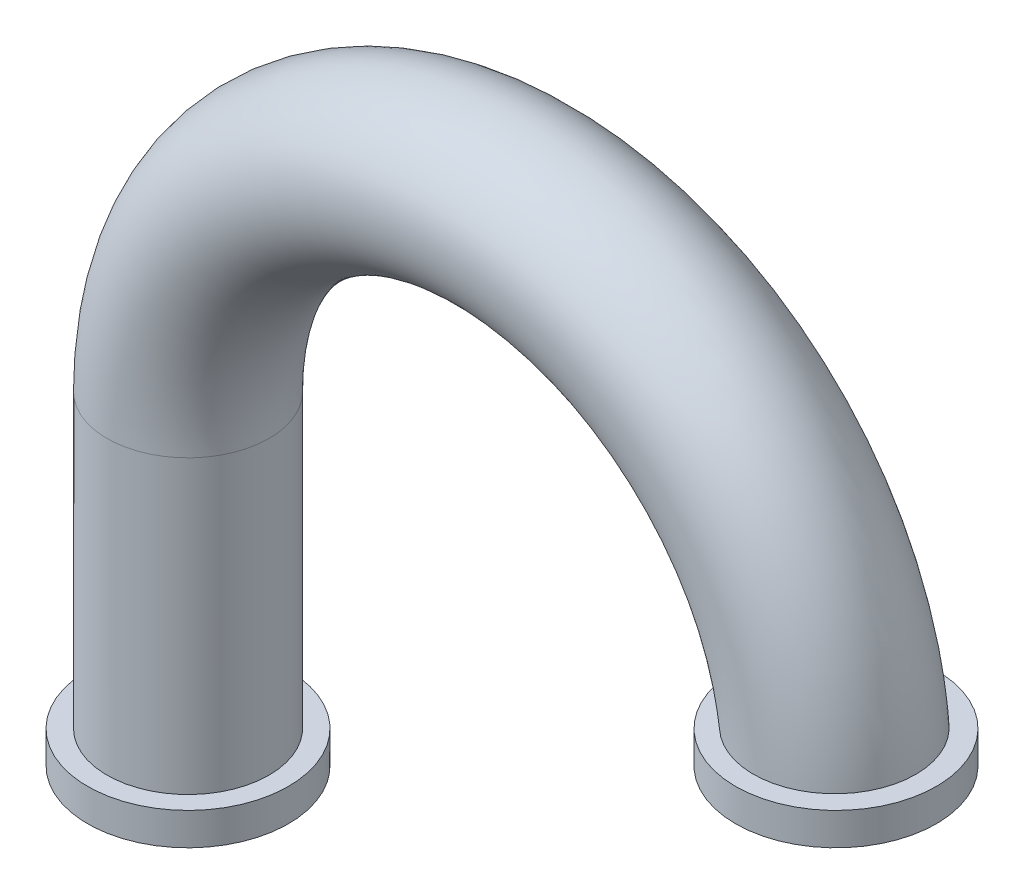
ISO-10303-21;
HEADER;
FILE_DESCRIPTION(('STEP AP214'),'2;1');
FILE_NAME('part.step','',(''),(''),'','','');
FILE_SCHEMA(('AUTOMOTIVE_DESIGN { 1 0 10303 214 1 1 1 1 }'));
ENDSEC;
DATA;
#1=APPLICATION_CONTEXT('core data for automotive mechanical design processes');
#2=APPLICATION_PROTOCOL_DEFINITION('international standard','automotive_design',2000,#1);
#3=PRODUCT_CONTEXT('',#1,'mechanical');
#4=PRODUCT('Part','Part','',(#3));
#5=PRODUCT_RELATED_PRODUCT_CATEGORY('part','',(#4));
#6=PRODUCT_DEFINITION_FORMATION('','',#4);
#7=PRODUCT_DEFINITION_CONTEXT('part definition',#1,'design');
#8=PRODUCT_DEFINITION('design','',#6,#7);
#9=PRODUCT_DEFINITION_SHAPE('','',#8);
#10=(LENGTH_UNIT() NAMED_UNIT(*) SI_UNIT(.MILLI.,.METRE.));
#11=(NAMED_UNIT(*) PLANE_ANGLE_UNIT() SI_UNIT($,.RADIAN.));
#12=(NAMED_UNIT(*) SI_UNIT($,.STERADIAN.) SOLID_ANGLE_UNIT());
#13=UNCERTAINTY_MEASURE_WITH_UNIT(LENGTH_MEASURE(1.E-05),#10,'distance_accuracy_value','');
#14=(GEOMETRIC_REPRESENTATION_CONTEXT(3) GLOBAL_UNCERTAINTY_ASSIGNED_CONTEXT((#13)) GLOBAL_UNIT_ASSIGNED_CONTEXT((#10,
#11,#12)) REPRESENTATION_CONTEXT('',''));
#15=CARTESIAN_POINT('',(0.,0.,0.));
#16=DIRECTION('',(0.,0.,1.));
#17=DIRECTION('',(1.,0.,0.));
#18=AXIS2_PLACEMENT_3D('',#15,#16,#17);
#19=CARTESIAN_POINT('',(-2.,0.,0.));
#20=DIRECTION('',(0.,-1.,0.));
#21=DIRECTION('',(1.,0.,0.));
#22=AXIS2_PLACEMENT_3D('',#19,#20,#21);
#23=CYLINDRICAL_SURFACE('',#22,0.25);
#24=CARTESIAN_POINT('',(-2.,0.,0.));
#25=DIRECTION('',(0.,-1.,0.));
#26=DIRECTION('',(1.,0.,0.));
#27=AXIS2_PLACEMENT_3D('',#24,#25,#26);
#28=CIRCLE('',#27,0.25);
#29=CARTESIAN_POINT('',(-1.75,0.,0.));
#30=VERTEX_POINT('',#29);
#31=EDGE_CURVE('E10',#30,#30,#28,.T.);
#32=ORIENTED_EDGE('',*,*,#31,.T.);
#33=EDGE_LOOP('',(#32));
#34=FACE_BOUND('',#33,.T.);
#35=CARTESIAN_POINT('',(-2.,-0.9,0.));
#36=DIRECTION('',(0.,-1.,0.));
#37=DIRECTION('',(0.,0.,-1.));
#38=AXIS2_PLACEMENT_3D('',#35,#36,#37);
#39=CIRCLE('',#38,0.25);
#40=CARTESIAN_POINT('',(-2.,-0.9,-0.25));
#41=VERTEX_POINT('',#40);
#42=EDGE_CURVE('E36',#41,#41,#39,.F.);
#43=ORIENTED_EDGE('',*,*,#42,.T.);
#44=EDGE_LOOP('',(#43));
#45=FACE_BOUND('',#44,.T.);
#46=ADVANCED_FACE('F31',(#34,#45),#23,.T.);
#47=CARTESIAN_POINT('',(-1.,0.,0.));
#48=DIRECTION('',(0.,0.,-1.));
#49=DIRECTION('',(-1.,0.,0.));
#50=AXIS2_PLACEMENT_3D('',#47,#48,#49);
#51=TOROIDAL_SURFACE('',#50,1.,0.25);
#52=CARTESIAN_POINT('',(-0.201401096317609,0.1,-0.156239637939055));
#53=CARTESIAN_POINT('',(-0.210190615714738,0.1,-0.145344468335609));
#54=CARTESIAN_POINT('',(-0.218071722109463,0.1,-0.133703962300581));
#55=CARTESIAN_POINT('',(-0.231777903107573,0.1,-0.109257379143088));
#56=CARTESIAN_POINT('',(-0.237600690405998,0.1,-0.0964500251078349));
#57=CARTESIAN_POINT('',(-0.247007650165607,0.1,-0.0700386597896411));
#58=CARTESIAN_POINT('',(-0.250592194362358,0.1,-0.0564347812071185));
#59=CARTESIAN_POINT('',(-0.255413188399921,0.1,-0.0288206461573356));
#60=CARTESIAN_POINT('',(-0.256650230465359,0.1,-0.014810493090211));
#61=CARTESIAN_POINT('',(-0.25674012956133,0.1,0.0131538110387401));
#62=CARTESIAN_POINT('',(-0.255603761287644,0.1,0.0271079282969862));
#63=CARTESIAN_POINT('',(-0.251003172674125,0.1,0.0546272137432172));
#64=CARTESIAN_POINT('',(-0.247538882318156,0.1,0.0681923702197628));
#65=CARTESIAN_POINT('',(-0.238388633745031,0.1,0.0945453892648772));
#66=CARTESIAN_POINT('',(-0.232703487129412,0.1,0.107333533818285));
#67=CARTESIAN_POINT('',(-0.219279773062284,0.1,0.131782096781473));
#68=CARTESIAN_POINT('',(-0.211541147629265,0.1,0.143442483335476));
#69=CARTESIAN_POINT('',(-0.194180832606932,0.1,0.16538311643698));
#70=CARTESIAN_POINT('',(-0.18454778916345,0.1,0.175654378083548));
#71=CARTESIAN_POINT('',(-0.163705864908683,0.1,0.194449314988614));
#72=CARTESIAN_POINT('',(-0.152496920871618,0.1,0.202972920096664));
#73=CARTESIAN_POINT('',(-0.128727432177818,0.1,0.218098495866874));
#74=CARTESIAN_POINT('',(-0.116157110459004,0.1,0.224685104803622));
#75=CARTESIAN_POINT('',(-0.0900925582958239,0.1,0.235665425768117));
#76=CARTESIAN_POINT('',(-0.0765983014200872,0.1,0.240059075031189));
#77=CARTESIAN_POINT('',(-0.0490037254832951,0.1,0.246545191192852));
#78=CARTESIAN_POINT('',(-0.0349009697958583,0.1,0.248627297728038));
#79=CARTESIAN_POINT('',(-0.00654593496886681,0.1,0.250394447161815));
#80=CARTESIAN_POINT('',(0.00770634481024823,0.1,0.250079479803207));
#81=CARTESIAN_POINT('',(0.0359552161641338,0.1,0.247058139402245));
#82=CARTESIAN_POINT('',(0.0499518104184512,0.1,0.244351791435899));
#83=CARTESIAN_POINT('',(0.0772894135497917,0.1,0.236620477359455));
#84=CARTESIAN_POINT('',(0.0906304308904239,0.1,0.23159554119143));
#85=CARTESIAN_POINT('',(0.116234413487642,0.1,0.219384869006445));
#86=CARTESIAN_POINT('',(0.128500521169366,0.1,0.212205722852414));
#87=CARTESIAN_POINT('',(0.151646839119026,0.1,0.195882113872184));
#88=CARTESIAN_POINT('',(0.162527077997131,0.1,0.186737691628039));
#89=CARTESIAN_POINT('',(0.182546180432526,0.1,0.166782766405174));
#90=CARTESIAN_POINT('',(0.191691887715395,0.1,0.155979129073377));
#91=CARTESIAN_POINT('',(0.208031942604488,0.1,0.132985122648441));
#92=CARTESIAN_POINT('',(0.215226328920527,0.1,0.120794781071202));
#93=CARTESIAN_POINT('',(0.227433287128235,0.1,0.095420262938804));
#94=CARTESIAN_POINT('',(0.232453530620286,0.1,0.0822397766594054));
#95=CARTESIAN_POINT('',(0.240204253167929,0.1,0.0552219448415194));
#96=CARTESIAN_POINT('',(0.242934765237328,0.1,0.0413846087766634));
#97=CARTESIAN_POINT('',(0.246023480720513,0.1,0.0134795739953029));
#98=CARTESIAN_POINT('',(0.246387057425578,0.1,-0.000587530219673161));
#99=CARTESIAN_POINT('',(0.244745727650856,0.1,-0.0285828177191339));
#100=CARTESIAN_POINT('',(0.242740835396257,0.1,-0.0425110018374756));
#101=CARTESIAN_POINT('',(0.236422429745385,0.1,-0.0698241464986361));
#102=CARTESIAN_POINT('',(0.232110367704181,0.1,-0.0832094428634803));
#103=CARTESIAN_POINT('',(0.221302613835047,0.1,-0.109067212165587));
#104=CARTESIAN_POINT('',(0.21480691921559,0.1,-0.121539683935882));
#105=CARTESIAN_POINT('',(0.19980999110781,0.1,-0.145233133026621));
#106=CARTESIAN_POINT('',(0.191306581255812,0.1,-0.156452732655624));
#107=CARTESIAN_POINT('',(0.172541402772618,0.1,-0.177309784421281));
#108=CARTESIAN_POINT('',(0.162279611876264,0.1,-0.18694721652102));
#109=CARTESIAN_POINT('',(0.140260536178512,0.1,-0.20439458897411));
#110=CARTESIAN_POINT('',(0.128499350856914,0.1,-0.212199606378334));
#111=CARTESIAN_POINT('',(0.103837454519992,0.1,-0.225732886882564));
#112=CARTESIAN_POINT('',(0.0909367201277325,0.1,-0.231461107366438));
#113=CARTESIAN_POINT('',(0.0643098227029985,0.1,-0.240701650163389));
#114=CARTESIAN_POINT('',(0.0505807148736025,0.1,-0.244205486570355));
#115=CARTESIAN_POINT('',(0.0227304868784085,0.1,-0.248868281721869));
#116=CARTESIAN_POINT('',(0.00860937300525726,0.1,-0.250027278084741));
#117=CARTESIAN_POINT('',(-0.019682310331464,0.1,-0.249971637934856));
#118=CARTESIAN_POINT('',(-0.033852861838134,0.1,-0.248747884057992));
#119=CARTESIAN_POINT('',(-0.0617929096379455,0.1,-0.243944388235435));
#120=CARTESIAN_POINT('',(-0.0755622983800522,0.1,-0.240364020446176));
#121=CARTESIAN_POINT('',(-0.102345731745449,0.1,-0.230935097081438));
#122=CARTESIAN_POINT('',(-0.115357430686798,0.1,-0.225079887987269));
#123=CARTESIAN_POINT('',(-0.140200186875687,0.1,-0.211269182973001));
#124=CARTESIAN_POINT('',(-0.152032625018917,0.1,-0.203316184310893));
#125=CARTESIAN_POINT('',(-0.170150558895375,0.1,-0.188776882063845));
#126=CARTESIAN_POINT('',(-0.176888616987927,0.1,-0.182745072414764));
#127=CARTESIAN_POINT('',(-0.189677604716015,0.1,-0.169992202553551));
#128=CARTESIAN_POINT('',(-0.195728533355725,0.1,-0.163271141342544));
#129=CARTESIAN_POINT('',(-0.201401096317609,0.1,-0.156239637939055));
#130=B_SPLINE_CURVE_WITH_KNOTS('',3,(#52,#53,#54,#55,#56,#57,#58,#59,#60,#61,#62,#63,#64,#65,
#66,#67,#68,#69,#70,#71,#72,#73,#74,#75,#76,#77,#78,#79,#80,#81,#82,#83,#84,#85,#86,#87,#88,#89,
#90,#91,#92,#93,#94,#95,#96,#97,#98,#99,#100,#101,#102,#103,#104,#105,#106,#107,#108,#109,#110,
#111,#112,#113,#114,#115,#116,#117,#118,#119,#120,#121,#122,#123,#124,#125,#126,#127,#128,#129),
.UNSPECIFIED.,.T.,.F.,(4,2,2,2,2,2,2,2,2,2,2,2,2,2,2,2,2,2,2,2,2,2,2,2,2,2,2,2,2,2,2,2,2,2,2,2,
2,2,4),(0.,0.0419631052503927,0.0839726964411998,0.125975308668973,0.167967323125762,
0.209769118662524,0.251572171514233,0.293359961905662,0.335148932332196,0.377196440897467,
0.419245636907758,0.461619835954524,0.503995247723257,0.54655982933734,0.589124593087473,
0.631688910508933,0.6742526782734,0.716687545691694,0.759121536933535,0.801384450217337,
0.843646525038763,0.88575823574167,0.927869339259047,0.969884810944664,1.01190003028372,
1.05388885042508,1.09587772424463,1.13791232469054,1.17994745743075,1.22209426111071,
1.26424192959939,1.30654943795309,1.34885626756105,1.39132529833847,1.43380561212635,
1.47641112039157,1.51896613717817,1.5460481653165,1.57313023270311),.UNSPECIFIED.);
#131=CARTESIAN_POINT('',(-0.201401096317609,0.1,-0.156239637939055));
#132=VERTEX_POINT('',#131);
#133=EDGE_CURVE('E48',#132,#132,#130,.T.);
#134=ORIENTED_EDGE('',*,*,#133,.T.);
#135=EDGE_LOOP('',(#134));
#136=FACE_BOUND('',#135,.T.);
#137=ORIENTED_EDGE('',*,*,#31,.F.);
#138=EDGE_LOOP('',(#137));
#139=FACE_BOUND('',#138,.T.);
#140=ADVANCED_FACE('F33',(#136,#139),#51,.T.);
#141=CARTESIAN_POINT('',(-2.,-1.,0.));
#142=DIRECTION('',(0.,-1.,0.));
#143=DIRECTION('',(0.,0.,1.));
#144=AXIS2_PLACEMENT_3D('',#141,#142,#143);
#145=PLANE('',#144);
#146=CARTESIAN_POINT('',(-2.,-1.,0.));
#147=DIRECTION('',(0.,-1.,0.));
#148=DIRECTION('',(0.,0.,1.));
#149=AXIS2_PLACEMENT_3D('',#146,#147,#148);
#150=CIRCLE('',#149,0.2);
#151=CARTESIAN_POINT('',(-2.,-1.,0.2));
#152=VERTEX_POINT('',#151);
#153=EDGE_CURVE('E40',#152,#152,#150,.T.);
#154=ORIENTED_EDGE('',*,*,#153,.F.);
#155=EDGE_LOOP('',(#154));
#156=FACE_BOUND('',#155,.T.);
#157=CARTESIAN_POINT('',(-2.,-1.,0.));
#158=DIRECTION('',(0.,-1.,0.));
#159=DIRECTION('',(0.,0.,-1.));
#160=AXIS2_PLACEMENT_3D('',#157,#158,#159);
#161=CIRCLE('',#160,0.31);
#162=CARTESIAN_POINT('',(-2.,-1.,-0.31));
#163=VERTEX_POINT('',#162);
#164=EDGE_CURVE('E96',#163,#163,#161,.T.);
#165=ORIENTED_EDGE('',*,*,#164,.T.);
#166=EDGE_LOOP('',(#165));
#167=FACE_BOUND('',#166,.T.);
#168=ADVANCED_FACE('F78',(#156,#167),#145,.T.);
#169=CARTESIAN_POINT('',(0.,0.,0.));
#170=DIRECTION('',(0.,1.,0.));
#171=DIRECTION('',(0.,0.,1.));
#172=AXIS2_PLACEMENT_3D('',#169,#170,#171);
#173=PLANE('',#172);
#174=CARTESIAN_POINT('',(0.,0.,0.));
#175=DIRECTION('',(0.,1.,0.));
#176=DIRECTION('',(0.,0.,1.));
#177=AXIS2_PLACEMENT_3D('',#174,#175,#176);
#178=CIRCLE('',#177,0.2);
#179=CARTESIAN_POINT('',(0.2,0.,0.));
#180=VERTEX_POINT('',#179);
#181=EDGE_CURVE('E53',#180,#180,#178,.T.);
#182=ORIENTED_EDGE('',*,*,#181,.T.);
#183=EDGE_LOOP('',(#182));
#184=FACE_BOUND('',#183,.T.);
#185=CARTESIAN_POINT('',(0.,0.,0.));
#186=DIRECTION('',(0.,1.,0.));
#187=DIRECTION('',(0.,0.,1.));
#188=AXIS2_PLACEMENT_3D('',#185,#186,#187);
#189=CIRCLE('',#188,0.31);
#190=CARTESIAN_POINT('',(0.,0.,0.31));
#191=VERTEX_POINT('',#190);
#192=EDGE_CURVE('E91',#191,#191,#189,.T.);
#193=ORIENTED_EDGE('',*,*,#192,.F.);
#194=EDGE_LOOP('',(#193));
#195=FACE_BOUND('',#194,.T.);
#196=ADVANCED_FACE('F74',(#184,#195),#173,.F.);
#197=CARTESIAN_POINT('',(-2.,0.,0.));
#198=DIRECTION('',(0.,-1.,0.));
#199=DIRECTION('',(1.,0.,0.));
#200=AXIS2_PLACEMENT_3D('',#197,#198,#199);
#201=CYLINDRICAL_SURFACE('',#200,0.2);
#202=CARTESIAN_POINT('',(-2.,0.,0.));
#203=DIRECTION('',(0.,-1.,0.));
#204=DIRECTION('',(0.,0.,1.));
#205=AXIS2_PLACEMENT_3D('',#202,#203,#204);
#206=CIRCLE('',#205,0.2);
#207=CARTESIAN_POINT('',(-2.2,0.,0.));
#208=VERTEX_POINT('',#207);
#209=EDGE_CURVE('E45',#208,#208,#206,.T.);
#210=ORIENTED_EDGE('',*,*,#209,.F.);
#211=EDGE_LOOP('',(#210));
#212=FACE_BOUND('',#211,.T.);
#213=ORIENTED_EDGE('',*,*,#153,.T.);
#214=EDGE_LOOP('',(#213));
#215=FACE_BOUND('',#214,.T.);
#216=ADVANCED_FACE('F70',(#212,#215),#201,.F.);
#217=CARTESIAN_POINT('',(-1.,0.,0.));
#218=DIRECTION('',(0.,0.,-1.));
#219=DIRECTION('',(-1.,0.,0.));
#220=AXIS2_PLACEMENT_3D('',#217,#218,#219);
#221=TOROIDAL_SURFACE('',#220,1.,0.2);
#222=CARTESIAN_POINT('',(-1.,0.,0.));
#223=DIRECTION('',(0.,0.,-1.));
#224=DIRECTION('',(-1.,0.,0.));
#225=AXIS2_PLACEMENT_3D('',#222,#223,#224);
#226=CIRCLE('',#225,1.2);
#227=EDGE_CURVE('',#208,#180,#226,.T.);
#228=ORIENTED_EDGE('',*,*,#209,.T.);
#229=ORIENTED_EDGE('',*,*,#181,.F.);
#230=ORIENTED_EDGE('',*,*,#227,.T.);
#231=ORIENTED_EDGE('',*,*,#227,.F.);
#232=EDGE_LOOP('',(#228,#230,#229,#231));
#233=FACE_BOUND('',#232,.T.);
#234=ADVANCED_FACE('F61',(#233),#221,.F.);
#235=CARTESIAN_POINT('',(0.,0.1,0.));
#236=DIRECTION('',(0.,1.,0.));
#237=DIRECTION('',(0.,0.,1.));
#238=AXIS2_PLACEMENT_3D('',#235,#236,#237);
#239=PLANE('',#238);
#240=CARTESIAN_POINT('',(0.,0.1,0.));
#241=DIRECTION('',(0.,1.,0.));
#242=DIRECTION('',(0.,0.,1.));
#243=AXIS2_PLACEMENT_3D('',#240,#241,#242);
#244=CIRCLE('',#243,0.31);
#245=CARTESIAN_POINT('',(0.,0.1,0.31));
#246=VERTEX_POINT('',#245);
#247=EDGE_CURVE('E54',#246,#246,#244,.T.);
#248=ORIENTED_EDGE('',*,*,#247,.T.);
#249=EDGE_LOOP('',(#248));
#250=FACE_BOUND('',#249,.T.);
#251=ORIENTED_EDGE('',*,*,#133,.F.);
#252=EDGE_LOOP('',(#251));
#253=FACE_BOUND('',#252,.T.);
#254=ADVANCED_FACE('F55',(#250,#253),#239,.T.);
#255=CARTESIAN_POINT('',(0.,0.1,0.));
#256=DIRECTION('',(0.,-1.,0.));
#257=DIRECTION('',(0.,0.,-1.));
#258=AXIS2_PLACEMENT_3D('',#255,#256,#257);
#259=CYLINDRICAL_SURFACE('',#258,0.31);
#260=ORIENTED_EDGE('',*,*,#247,.F.);
#261=EDGE_LOOP('',(#260));
#262=FACE_BOUND('',#261,.T.);
#263=ORIENTED_EDGE('',*,*,#192,.T.);
#264=EDGE_LOOP('',(#263));
#265=FACE_BOUND('',#264,.T.);
#266=ADVANCED_FACE('F60',(#262,#265),#259,.T.);
#267=CARTESIAN_POINT('',(-2.,-0.9,0.));
#268=DIRECTION('',(0.,-1.,0.));
#269=DIRECTION('',(0.,0.,-1.));
#270=AXIS2_PLACEMENT_3D('',#267,#268,#269);
#271=CYLINDRICAL_SURFACE('',#270,0.31);
#272=CARTESIAN_POINT('',(-2.,-0.9,0.));
#273=DIRECTION('',(0.,-1.,0.));
#274=DIRECTION('',(0.,0.,-1.));
#275=AXIS2_PLACEMENT_3D('',#272,#273,#274);
#276=CIRCLE('',#275,0.31);
#277=CARTESIAN_POINT('',(-2.,-0.9,-0.31));
#278=VERTEX_POINT('',#277);
#279=EDGE_CURVE('E92',#278,#278,#276,.T.);
#280=ORIENTED_EDGE('',*,*,#279,.T.);
#281=EDGE_LOOP('',(#280));
#282=FACE_BOUND('',#281,.T.);
#283=ORIENTED_EDGE('',*,*,#164,.F.);
#284=EDGE_LOOP('',(#283));
#285=FACE_BOUND('',#284,.T.);
#286=ADVANCED_FACE('F63',(#282,#285),#271,.T.);
#287=CARTESIAN_POINT('',(-2.,-0.9,0.));
#288=DIRECTION('',(0.,-1.,0.));
#289=DIRECTION('',(0.,0.,-1.));
#290=AXIS2_PLACEMENT_3D('',#287,#288,#289);
#291=PLANE('',#290);
#292=ORIENTED_EDGE('',*,*,#42,.F.);
#293=EDGE_LOOP('',(#292));
#294=FACE_BOUND('',#293,.T.);
#295=ORIENTED_EDGE('',*,*,#279,.F.);
#296=EDGE_LOOP('',(#295));
#297=FACE_BOUND('',#296,.T.);
#298=ADVANCED_FACE('F115',(#294,#297),#291,.F.);
#299=CLOSED_SHELL('',(#46,#140,#168,#196,#216,#234,#254,#266,#286,#298));
#300=MANIFOLD_SOLID_BREP('B2',#299);
#301=ADVANCED_BREP_SHAPE_REPRESENTATION('',(#18,#300),#14);
#302=SHAPE_DEFINITION_REPRESENTATION(#9,#301);
ENDSEC;
END-ISO-10303-21;
